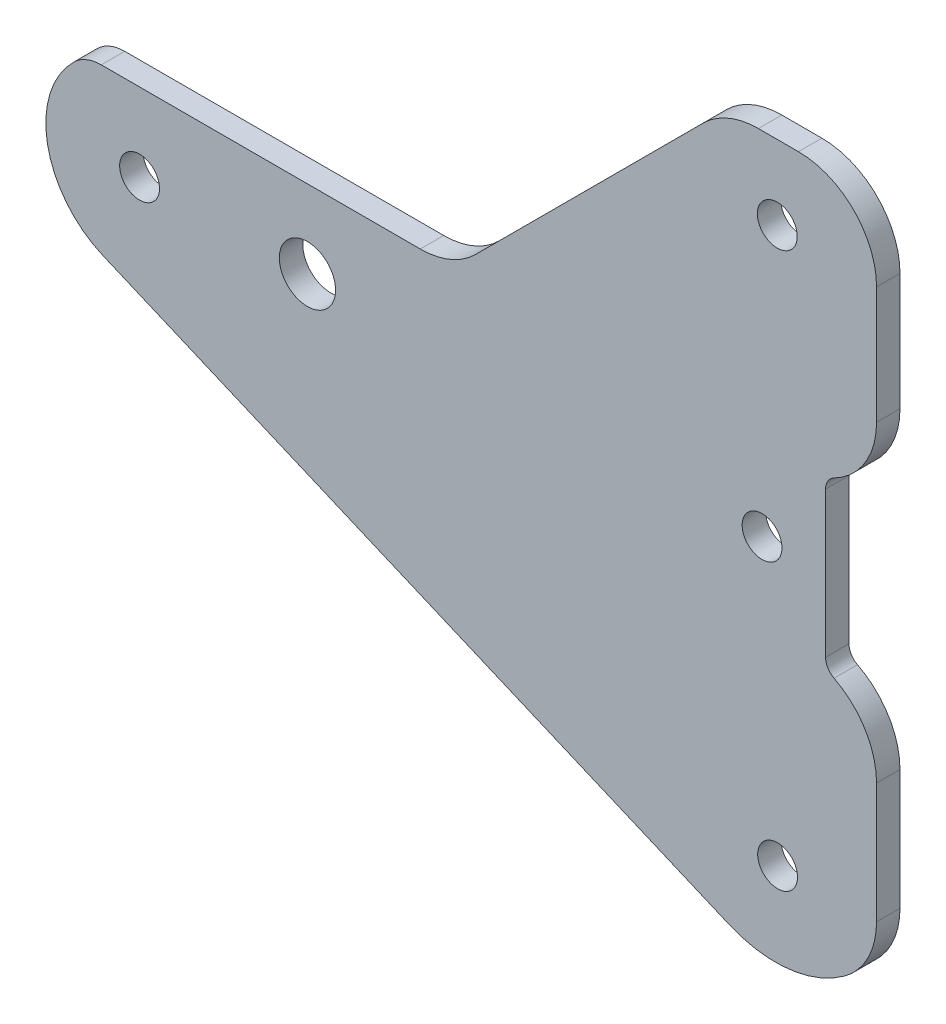
ISO-10303-21;
HEADER;
FILE_DESCRIPTION(('STEP AP214'),'2;1');
FILE_NAME('part.step','',(''),(''),'','','');
FILE_SCHEMA(('AUTOMOTIVE_DESIGN { 1 0 10303 214 1 1 1 1 }'));
ENDSEC;
DATA;
#1=APPLICATION_CONTEXT('core data for automotive mechanical design processes');
#2=APPLICATION_PROTOCOL_DEFINITION('international standard','automotive_design',2000,#1);
#3=PRODUCT_CONTEXT('',#1,'mechanical');
#4=PRODUCT('Part','Part','',(#3));
#5=PRODUCT_RELATED_PRODUCT_CATEGORY('part','',(#4));
#6=PRODUCT_DEFINITION_FORMATION('','',#4);
#7=PRODUCT_DEFINITION_CONTEXT('part definition',#1,'design');
#8=PRODUCT_DEFINITION('design','',#6,#7);
#9=PRODUCT_DEFINITION_SHAPE('','',#8);
#10=(LENGTH_UNIT() NAMED_UNIT(*) SI_UNIT(.MILLI.,.METRE.));
#11=(NAMED_UNIT(*) PLANE_ANGLE_UNIT() SI_UNIT($,.RADIAN.));
#12=(NAMED_UNIT(*) SI_UNIT($,.STERADIAN.) SOLID_ANGLE_UNIT());
#13=UNCERTAINTY_MEASURE_WITH_UNIT(LENGTH_MEASURE(1.E-05),#10,'distance_accuracy_value','');
#14=(GEOMETRIC_REPRESENTATION_CONTEXT(3) GLOBAL_UNCERTAINTY_ASSIGNED_CONTEXT((#13)) GLOBAL_UNIT_ASSIGNED_CONTEXT((#10,
#11,#12)) REPRESENTATION_CONTEXT('',''));
#15=CARTESIAN_POINT('',(0.,0.,0.));
#16=DIRECTION('',(0.,0.,1.));
#17=DIRECTION('',(1.,0.,0.));
#18=AXIS2_PLACEMENT_3D('',#15,#16,#17);
#19=CARTESIAN_POINT('',(-40.3202178649894,33.0966649260062,3.));
#20=DIRECTION('',(0.,0.,1.));
#21=DIRECTION('',(1.,0.,0.));
#22=AXIS2_PLACEMENT_3D('',#19,#20,#21);
#23=PLANE('',#22);
#24=CARTESIAN_POINT('',(46.2645708374084,-7.40903050527662,3.));
#25=DIRECTION('',(0.,0.,1.));
#26=DIRECTION('',(1.,0.,0.));
#27=AXIS2_PLACEMENT_3D('',#24,#25,#26);
#28=CIRCLE('',#27,2.55);
#29=CARTESIAN_POINT('',(48.8145708374084,-7.40903050527662,3.));
#30=VERTEX_POINT('',#29);
#31=EDGE_CURVE('E374',#30,#30,#28,.T.);
#32=ORIENTED_EDGE('',*,*,#31,.F.);
#33=EDGE_LOOP('',(#32));
#34=FACE_BOUND('',#33,.T.);
#35=CARTESIAN_POINT('',(46.2217882114393,63.594399754973,3.));
#36=DIRECTION('',(0.,0.,1.));
#37=DIRECTION('',(1.,0.,0.));
#38=AXIS2_PLACEMENT_3D('',#35,#36,#37);
#39=CIRCLE('',#38,2.55);
#40=CARTESIAN_POINT('',(48.7717882114393,63.594399754973,3.));
#41=VERTEX_POINT('',#40);
#42=EDGE_CURVE('E386',#41,#41,#39,.T.);
#43=ORIENTED_EDGE('',*,*,#42,.F.);
#44=EDGE_LOOP('',(#43));
#45=FACE_BOUND('',#44,.T.);
#46=CARTESIAN_POINT('',(-40.3202178649894,33.0966649260062,3.));
#47=DIRECTION('',(0.,0.,1.));
#48=DIRECTION('',(1.,0.,0.));
#49=AXIS2_PLACEMENT_3D('',#46,#47,#48);
#50=CIRCLE('',#49,4.99999999999999);
#51=CARTESIAN_POINT('',(-40.3202178649894,38.0966649260062,3.));
#52=VERTEX_POINT('',#51);
#53=CARTESIAN_POINT('',(-43.8194259527344,36.6681551973999,3.));
#54=VERTEX_POINT('',#53);
#55=EDGE_CURVE('E226',#52,#54,#50,.T.);
#56=ORIENTED_EDGE('',*,*,#55,.T.);
#57=CARTESIAN_POINT('',(-35.4213265421463,28.096578546055,3.));
#58=DIRECTION('',(0.,0.,1.));
#59=DIRECTION('',(1.,0.,0.));
#60=AXIS2_PLACEMENT_3D('',#57,#58,#59);
#61=CIRCLE('',#60,12.);
#62=CARTESIAN_POINT('',(-40.1158831435968,17.0529768547689,3.));
#63=VERTEX_POINT('',#62);
#64=EDGE_CURVE('E124',#54,#63,#61,.T.);
#65=ORIENTED_EDGE('',*,*,#64,.T.);
#66=DIRECTION('',(0.92030014094051,-0.391213050120874,0.));
#67=VECTOR('',#66,1.);
#68=CARTESIAN_POINT('',(-40.1158831435968,17.0529768547689,3.));
#69=LINE('',#68,#67);
#70=CARTESIAN_POINT('',(40.1158831435968,-17.0529768547689,3.));
#71=VERTEX_POINT('',#70);
#72=EDGE_CURVE('E271',#63,#71,#69,.T.);
#73=ORIENTED_EDGE('',*,*,#72,.T.);
#74=CARTESIAN_POINT('',(45.9840788954099,-3.24847474066127,3.));
#75=DIRECTION('',(0.,0.,1.));
#76=DIRECTION('',(1.,0.,0.));
#77=AXIS2_PLACEMENT_3D('',#74,#75,#76);
#78=CIRCLE('',#77,15.);
#79=CARTESIAN_POINT('',(54.8272068434977,-15.3645420933029,3.));
#80=VERTEX_POINT('',#79);
#81=EDGE_CURVE('E290',#71,#80,#78,.T.);
#82=ORIENTED_EDGE('',*,*,#81,.T.);
#83=CARTESIAN_POINT('',(48.9317882114392,-7.28716385820849,3.));
#84=DIRECTION('',(0.,0.,1.));
#85=DIRECTION('',(1.,0.,0.));
#86=AXIS2_PLACEMENT_3D('',#83,#84,#85);
#87=CIRCLE('',#86,10.);
#88=CARTESIAN_POINT('',(58.9317882114391,-7.28716385820849,3.));
#89=VERTEX_POINT('',#88);
#90=EDGE_CURVE('E287',#80,#89,#87,.T.);
#91=ORIENTED_EDGE('',*,*,#90,.T.);
#92=DIRECTION('',(0.,1.,0.));
#93=VECTOR('',#92,1.);
#94=CARTESIAN_POINT('',(58.9317882114391,-7.28716385820849,3.));
#95=LINE('',#94,#93);
#96=CARTESIAN_POINT('',(58.9317882114392,8.09283614179151,3.));
#97=VERTEX_POINT('',#96);
#98=EDGE_CURVE('E289',#89,#97,#95,.T.);
#99=ORIENTED_EDGE('',*,*,#98,.T.);
#100=CARTESIAN_POINT('',(48.9317882114392,8.09283614179151,3.));
#101=DIRECTION('',(0.,0.,1.));
#102=DIRECTION('',(1.,0.,0.));
#103=AXIS2_PLACEMENT_3D('',#100,#101,#102);
#104=CIRCLE('',#103,9.99999999999999);
#105=CARTESIAN_POINT('',(53.4901215447725,16.9934876472838,3.));
#106=VERTEX_POINT('',#105);
#107=EDGE_CURVE('E292',#97,#106,#104,.T.);
#108=ORIENTED_EDGE('',*,*,#107,.T.);
#109=CARTESIAN_POINT('',(54.4017882114392,18.7736179483823,3.));
#110=DIRECTION('',(0.,0.,-1.));
#111=DIRECTION('',(-1.,0.,0.));
#112=AXIS2_PLACEMENT_3D('',#109,#110,#111);
#113=CIRCLE('',#112,2.);
#114=CARTESIAN_POINT('',(52.4017882114392,18.7736179483823,3.));
#115=VERTEX_POINT('',#114);
#116=EDGE_CURVE('E298',#106,#115,#113,.T.);
#117=ORIENTED_EDGE('',*,*,#116,.T.);
#118=DIRECTION('',(0.,1.,0.));
#119=VECTOR('',#118,1.);
#120=CARTESIAN_POINT('',(52.4017882114392,18.7736179483823,3.));
#121=LINE('',#120,#119);
#122=CARTESIAN_POINT('',(52.4017882114392,37.4136179483823,3.));
#123=VERTEX_POINT('',#122);
#124=EDGE_CURVE('E300',#115,#123,#121,.T.);
#125=ORIENTED_EDGE('',*,*,#124,.T.);
#126=CARTESIAN_POINT('',(54.4017882114392,37.4136179483823,3.));
#127=DIRECTION('',(0.,0.,-1.));
#128=DIRECTION('',(-1.,0.,0.));
#129=AXIS2_PLACEMENT_3D('',#126,#127,#128);
#130=CIRCLE('',#129,2.);
#131=CARTESIAN_POINT('',(53.4901215447725,39.1937482494807,3.));
#132=VERTEX_POINT('',#131);
#133=EDGE_CURVE('E302',#123,#132,#130,.T.);
#134=ORIENTED_EDGE('',*,*,#133,.T.);
#135=CARTESIAN_POINT('',(48.9317882114392,48.094399754973,3.));
#136=DIRECTION('',(0.,0.,1.));
#137=DIRECTION('',(1.,0.,0.));
#138=AXIS2_PLACEMENT_3D('',#135,#136,#137);
#139=CIRCLE('',#138,10.);
#140=CARTESIAN_POINT('',(58.9317882114392,48.094399754973,3.));
#141=VERTEX_POINT('',#140);
#142=EDGE_CURVE('E304',#132,#141,#139,.T.);
#143=ORIENTED_EDGE('',*,*,#142,.T.);
#144=DIRECTION('',(0.,1.,0.));
#145=VECTOR('',#144,1.);
#146=CARTESIAN_POINT('',(58.9317882114392,48.094399754973,3.));
#147=LINE('',#146,#145);
#148=CARTESIAN_POINT('',(58.9317882114391,63.094399754973,3.));
#149=VERTEX_POINT('',#148);
#150=EDGE_CURVE('E306',#141,#149,#147,.T.);
#151=ORIENTED_EDGE('',*,*,#150,.T.);
#152=CARTESIAN_POINT('',(48.9317882114392,63.094399754973,3.));
#153=DIRECTION('',(0.,0.,1.));
#154=DIRECTION('',(1.,0.,0.));
#155=AXIS2_PLACEMENT_3D('',#152,#153,#154);
#156=CIRCLE('',#155,9.99999999999999);
#157=CARTESIAN_POINT('',(48.9317882114392,73.094399754973,3.));
#158=VERTEX_POINT('',#157);
#159=EDGE_CURVE('E308',#149,#158,#156,.T.);
#160=ORIENTED_EDGE('',*,*,#159,.T.);
#161=DIRECTION('',(-1.,0.,0.));
#162=VECTOR('',#161,1.);
#163=CARTESIAN_POINT('',(43.8017882114392,73.094399754973,3.));
#164=LINE('',#163,#162);
#165=CARTESIAN_POINT('',(43.8017882114392,73.094399754973,3.));
#166=VERTEX_POINT('',#165);
#167=EDGE_CURVE('E310',#158,#166,#164,.T.);
#168=ORIENTED_EDGE('',*,*,#167,.T.);
#169=CARTESIAN_POINT('',(43.8017882114392,63.094399754973,3.));
#170=DIRECTION('',(0.,0.,1.));
#171=DIRECTION('',(-1.,0.,0.));
#172=AXIS2_PLACEMENT_3D('',#169,#170,#171);
#173=CIRCLE('',#172,10.);
#174=CARTESIAN_POINT('',(36.7307203995736,70.1654675668385,3.));
#175=VERTEX_POINT('',#174);
#176=EDGE_CURVE('E173',#166,#175,#173,.T.);
#177=ORIENTED_EDGE('',*,*,#176,.T.);
#178=DIRECTION('',(-0.707106781186546,-0.707106781186549,0.));
#179=VECTOR('',#178,1.);
#180=CARTESIAN_POINT('',(7.59084994687604,41.0255971141408,3.));
#181=LINE('',#180,#179);
#182=CARTESIAN_POINT('',(7.59084994687608,41.0255971141408,3.));
#183=VERTEX_POINT('',#182);
#184=EDGE_CURVE('E167',#175,#183,#181,.T.);
#185=ORIENTED_EDGE('',*,*,#184,.T.);
#186=CARTESIAN_POINT('',(0.519782135010638,48.0966649260062,3.));
#187=DIRECTION('',(0.,0.,-1.));
#188=DIRECTION('',(-1.,0.,0.));
#189=AXIS2_PLACEMENT_3D('',#186,#187,#188);
#190=CIRCLE('',#189,9.99999999999993);
#191=CARTESIAN_POINT('',(0.519782135010638,38.0966649260062,3.));
#192=VERTEX_POINT('',#191);
#193=EDGE_CURVE('E171',#183,#192,#190,.T.);
#194=ORIENTED_EDGE('',*,*,#193,.T.);
#195=DIRECTION('',(-1.,0.,0.));
#196=VECTOR('',#195,1.);
#197=CARTESIAN_POINT('',(-40.3202178649894,38.0966649260062,3.));
#198=LINE('',#197,#196);
#199=EDGE_CURVE('E51',#192,#52,#198,.T.);
#200=ORIENTED_EDGE('',*,*,#199,.T.);
#201=EDGE_LOOP('',(#56,#65,#73,#82,#91,#99,#108,#117,#125,#134,#143,#151,#160,#168,#177,#185,
#194,#200));
#202=FACE_BOUND('',#201,.T.);
#203=CARTESIAN_POINT('',(-13.9313265421463,28.096578546055,3.));
#204=DIRECTION('',(0.,0.,1.));
#205=DIRECTION('',(1.,0.,0.));
#206=AXIS2_PLACEMENT_3D('',#203,#204,#205);
#207=CIRCLE('',#206,3.6);
#208=CARTESIAN_POINT('',(-10.3313265421463,28.096578546055,3.));
#209=VERTEX_POINT('',#208);
#210=EDGE_CURVE('E195',#209,#209,#207,.T.);
#211=ORIENTED_EDGE('',*,*,#210,.F.);
#212=EDGE_LOOP('',(#211));
#213=FACE_BOUND('',#212,.T.);
#214=CARTESIAN_POINT('',(44.2717882114392,28.094399754973,3.));
#215=DIRECTION('',(0.,0.,1.));
#216=DIRECTION('',(1.,0.,0.));
#217=AXIS2_PLACEMENT_3D('',#214,#215,#216);
#218=CIRCLE('',#217,2.55);
#219=CARTESIAN_POINT('',(46.8217882114392,28.094399754973,3.));
#220=VERTEX_POINT('',#219);
#221=EDGE_CURVE('E380',#220,#220,#218,.T.);
#222=ORIENTED_EDGE('',*,*,#221,.F.);
#223=EDGE_LOOP('',(#222));
#224=FACE_BOUND('',#223,.T.);
#225=CARTESIAN_POINT('',(-35.4213265421463,28.096578546055,3.));
#226=DIRECTION('',(0.,0.,1.));
#227=DIRECTION('',(1.,0.,0.));
#228=AXIS2_PLACEMENT_3D('',#225,#226,#227);
#229=CIRCLE('',#228,2.55);
#230=CARTESIAN_POINT('',(-32.8713265421463,28.096578546055,3.));
#231=VERTEX_POINT('',#230);
#232=EDGE_CURVE('E365',#231,#231,#229,.T.);
#233=ORIENTED_EDGE('',*,*,#232,.F.);
#234=EDGE_LOOP('',(#233));
#235=FACE_BOUND('',#234,.T.);
#236=ADVANCED_FACE('F34',(#34,#45,#202,#213,#224,#235),#23,.T.);
#237=CARTESIAN_POINT('',(-40.3202178649894,33.0966649260062,0.));
#238=DIRECTION('',(0.,0.,1.));
#239=DIRECTION('',(1.,0.,0.));
#240=AXIS2_PLACEMENT_3D('',#237,#238,#239);
#241=PLANE('',#240);
#242=CARTESIAN_POINT('',(-40.3202178649894,33.0966649260062,0.));
#243=DIRECTION('',(0.,0.,1.));
#244=DIRECTION('',(1.,0.,0.));
#245=AXIS2_PLACEMENT_3D('',#242,#243,#244);
#246=CIRCLE('',#245,4.99999999999999);
#247=CARTESIAN_POINT('',(-40.3202178649894,38.0966649260062,0.));
#248=VERTEX_POINT('',#247);
#249=CARTESIAN_POINT('',(-43.8194259527344,36.6681551973999,0.));
#250=VERTEX_POINT('',#249);
#251=EDGE_CURVE('E191',#248,#250,#246,.T.);
#252=ORIENTED_EDGE('',*,*,#251,.F.);
#253=DIRECTION('',(-1.,0.,0.));
#254=VECTOR('',#253,1.);
#255=CARTESIAN_POINT('',(-40.3202178649894,38.0966649260062,0.));
#256=LINE('',#255,#254);
#257=CARTESIAN_POINT('',(0.519782135010638,38.0966649260062,0.));
#258=VERTEX_POINT('',#257);
#259=EDGE_CURVE('E116',#258,#248,#256,.T.);
#260=ORIENTED_EDGE('',*,*,#259,.F.);
#261=CARTESIAN_POINT('',(0.519782135010638,48.0966649260062,0.));
#262=DIRECTION('',(0.,0.,-1.));
#263=DIRECTION('',(-1.,0.,0.));
#264=AXIS2_PLACEMENT_3D('',#261,#262,#263);
#265=CIRCLE('',#264,9.99999999999993);
#266=CARTESIAN_POINT('',(7.59084994687608,41.0255971141408,0.));
#267=VERTEX_POINT('',#266);
#268=EDGE_CURVE('E110',#267,#258,#265,.T.);
#269=ORIENTED_EDGE('',*,*,#268,.F.);
#270=DIRECTION('',(-0.707106781186546,-0.707106781186549,0.));
#271=VECTOR('',#270,1.);
#272=CARTESIAN_POINT('',(7.59084994687604,41.0255971141408,0.));
#273=LINE('',#272,#271);
#274=CARTESIAN_POINT('',(36.7307203995736,70.1654675668385,0.));
#275=VERTEX_POINT('',#274);
#276=EDGE_CURVE('E181',#275,#267,#273,.T.);
#277=ORIENTED_EDGE('',*,*,#276,.F.);
#278=CARTESIAN_POINT('',(43.8017882114392,63.094399754973,0.));
#279=DIRECTION('',(0.,0.,1.));
#280=DIRECTION('',(-1.,0.,0.));
#281=AXIS2_PLACEMENT_3D('',#278,#279,#280);
#282=CIRCLE('',#281,10.);
#283=CARTESIAN_POINT('',(43.8017882114392,73.094399754973,0.));
#284=VERTEX_POINT('',#283);
#285=EDGE_CURVE('E221',#284,#275,#282,.T.);
#286=ORIENTED_EDGE('',*,*,#285,.F.);
#287=DIRECTION('',(-1.,0.,0.));
#288=VECTOR('',#287,1.);
#289=CARTESIAN_POINT('',(43.8017882114392,73.094399754973,0.));
#290=LINE('',#289,#288);
#291=CARTESIAN_POINT('',(48.9317882114392,73.094399754973,0.));
#292=VERTEX_POINT('',#291);
#293=EDGE_CURVE('E219',#292,#284,#290,.T.);
#294=ORIENTED_EDGE('',*,*,#293,.F.);
#295=CARTESIAN_POINT('',(48.9317882114392,63.094399754973,0.));
#296=DIRECTION('',(0.,0.,1.));
#297=DIRECTION('',(1.,0.,0.));
#298=AXIS2_PLACEMENT_3D('',#295,#296,#297);
#299=CIRCLE('',#298,9.99999999999999);
#300=CARTESIAN_POINT('',(58.9317882114391,63.094399754973,0.));
#301=VERTEX_POINT('',#300);
#302=EDGE_CURVE('E217',#301,#292,#299,.T.);
#303=ORIENTED_EDGE('',*,*,#302,.F.);
#304=DIRECTION('',(0.,1.,0.));
#305=VECTOR('',#304,1.);
#306=CARTESIAN_POINT('',(58.9317882114392,48.094399754973,0.));
#307=LINE('',#306,#305);
#308=CARTESIAN_POINT('',(58.9317882114392,48.094399754973,0.));
#309=VERTEX_POINT('',#308);
#310=EDGE_CURVE('E215',#309,#301,#307,.T.);
#311=ORIENTED_EDGE('',*,*,#310,.F.);
#312=CARTESIAN_POINT('',(48.9317882114392,48.094399754973,0.));
#313=DIRECTION('',(0.,0.,1.));
#314=DIRECTION('',(1.,0.,0.));
#315=AXIS2_PLACEMENT_3D('',#312,#313,#314);
#316=CIRCLE('',#315,10.);
#317=CARTESIAN_POINT('',(53.4901215447725,39.1937482494807,0.));
#318=VERTEX_POINT('',#317);
#319=EDGE_CURVE('E213',#318,#309,#316,.T.);
#320=ORIENTED_EDGE('',*,*,#319,.F.);
#321=CARTESIAN_POINT('',(54.4017882114392,37.4136179483823,0.));
#322=DIRECTION('',(0.,0.,-1.));
#323=DIRECTION('',(-1.,0.,0.));
#324=AXIS2_PLACEMENT_3D('',#321,#322,#323);
#325=CIRCLE('',#324,2.);
#326=CARTESIAN_POINT('',(52.4017882114392,37.4136179483823,0.));
#327=VERTEX_POINT('',#326);
#328=EDGE_CURVE('E211',#327,#318,#325,.T.);
#329=ORIENTED_EDGE('',*,*,#328,.F.);
#330=DIRECTION('',(0.,1.,0.));
#331=VECTOR('',#330,1.);
#332=CARTESIAN_POINT('',(52.4017882114392,18.7736179483823,0.));
#333=LINE('',#332,#331);
#334=CARTESIAN_POINT('',(52.4017882114392,18.7736179483823,0.));
#335=VERTEX_POINT('',#334);
#336=EDGE_CURVE('E209',#335,#327,#333,.T.);
#337=ORIENTED_EDGE('',*,*,#336,.F.);
#338=CARTESIAN_POINT('',(54.4017882114392,18.7736179483823,0.));
#339=DIRECTION('',(0.,0.,-1.));
#340=DIRECTION('',(-1.,0.,0.));
#341=AXIS2_PLACEMENT_3D('',#338,#339,#340);
#342=CIRCLE('',#341,2.);
#343=CARTESIAN_POINT('',(53.4901215447725,16.9934876472838,0.));
#344=VERTEX_POINT('',#343);
#345=EDGE_CURVE('E207',#344,#335,#342,.T.);
#346=ORIENTED_EDGE('',*,*,#345,.F.);
#347=CARTESIAN_POINT('',(48.9317882114392,8.09283614179151,0.));
#348=DIRECTION('',(0.,0.,1.));
#349=DIRECTION('',(1.,0.,0.));
#350=AXIS2_PLACEMENT_3D('',#347,#348,#349);
#351=CIRCLE('',#350,9.99999999999999);
#352=CARTESIAN_POINT('',(58.9317882114392,8.09283614179151,0.));
#353=VERTEX_POINT('',#352);
#354=EDGE_CURVE('E205',#353,#344,#351,.T.);
#355=ORIENTED_EDGE('',*,*,#354,.F.);
#356=DIRECTION('',(0.,1.,0.));
#357=VECTOR('',#356,1.);
#358=CARTESIAN_POINT('',(58.9317882114391,-7.28716385820849,0.));
#359=LINE('',#358,#357);
#360=CARTESIAN_POINT('',(58.9317882114391,-7.28716385820849,0.));
#361=VERTEX_POINT('',#360);
#362=EDGE_CURVE('E203',#361,#353,#359,.T.);
#363=ORIENTED_EDGE('',*,*,#362,.F.);
#364=CARTESIAN_POINT('',(48.9317882114392,-7.28716385820849,0.));
#365=DIRECTION('',(0.,0.,1.));
#366=DIRECTION('',(1.,0.,0.));
#367=AXIS2_PLACEMENT_3D('',#364,#365,#366);
#368=CIRCLE('',#367,10.);
#369=CARTESIAN_POINT('',(54.8272068434977,-15.3645420933029,0.));
#370=VERTEX_POINT('',#369);
#371=EDGE_CURVE('E201',#370,#361,#368,.T.);
#372=ORIENTED_EDGE('',*,*,#371,.F.);
#373=CARTESIAN_POINT('',(45.9840788954099,-3.24847474066127,0.));
#374=DIRECTION('',(0.,0.,1.));
#375=DIRECTION('',(1.,0.,0.));
#376=AXIS2_PLACEMENT_3D('',#373,#374,#375);
#377=CIRCLE('',#376,15.);
#378=CARTESIAN_POINT('',(40.1158831435968,-17.0529768547689,0.));
#379=VERTEX_POINT('',#378);
#380=EDGE_CURVE('E199',#379,#370,#377,.T.);
#381=ORIENTED_EDGE('',*,*,#380,.F.);
#382=DIRECTION('',(0.92030014094051,-0.391213050120874,0.));
#383=VECTOR('',#382,1.);
#384=CARTESIAN_POINT('',(-40.1158831435968,17.0529768547689,0.));
#385=LINE('',#384,#383);
#386=CARTESIAN_POINT('',(-40.1158831435968,17.0529768547689,0.));
#387=VERTEX_POINT('',#386);
#388=EDGE_CURVE('E197',#387,#379,#385,.T.);
#389=ORIENTED_EDGE('',*,*,#388,.F.);
#390=CARTESIAN_POINT('',(-35.4213265421463,28.096578546055,0.));
#391=DIRECTION('',(0.,0.,1.));
#392=DIRECTION('',(1.,0.,0.));
#393=AXIS2_PLACEMENT_3D('',#390,#391,#392);
#394=CIRCLE('',#393,12.);
#395=EDGE_CURVE('E194',#250,#387,#394,.T.);
#396=ORIENTED_EDGE('',*,*,#395,.F.);
#397=EDGE_LOOP('',(#252,#260,#269,#277,#286,#294,#303,#311,#320,#329,#337,#346,#355,#363,#372,
#381,#389,#396));
#398=FACE_BOUND('',#397,.T.);
#399=CARTESIAN_POINT('',(-13.9313265421463,28.096578546055,0.));
#400=DIRECTION('',(0.,0.,1.));
#401=DIRECTION('',(1.,0.,0.));
#402=AXIS2_PLACEMENT_3D('',#399,#400,#401);
#403=CIRCLE('',#402,3.6);
#404=CARTESIAN_POINT('',(-10.3313265421463,28.096578546055,0.));
#405=VERTEX_POINT('',#404);
#406=EDGE_CURVE('E389',#405,#405,#403,.T.);
#407=ORIENTED_EDGE('',*,*,#406,.T.);
#408=EDGE_LOOP('',(#407));
#409=FACE_BOUND('',#408,.T.);
#410=CARTESIAN_POINT('',(46.2217882114393,63.594399754973,0.));
#411=DIRECTION('',(0.,0.,1.));
#412=DIRECTION('',(1.,0.,0.));
#413=AXIS2_PLACEMENT_3D('',#410,#411,#412);
#414=CIRCLE('',#413,2.55);
#415=CARTESIAN_POINT('',(48.7717882114393,63.594399754973,0.));
#416=VERTEX_POINT('',#415);
#417=EDGE_CURVE('E383',#416,#416,#414,.T.);
#418=ORIENTED_EDGE('',*,*,#417,.T.);
#419=EDGE_LOOP('',(#418));
#420=FACE_BOUND('',#419,.T.);
#421=CARTESIAN_POINT('',(44.2717882114392,28.094399754973,0.));
#422=DIRECTION('',(0.,0.,1.));
#423=DIRECTION('',(1.,0.,0.));
#424=AXIS2_PLACEMENT_3D('',#421,#422,#423);
#425=CIRCLE('',#424,2.55);
#426=CARTESIAN_POINT('',(46.8217882114392,28.094399754973,0.));
#427=VERTEX_POINT('',#426);
#428=EDGE_CURVE('E377',#427,#427,#425,.T.);
#429=ORIENTED_EDGE('',*,*,#428,.T.);
#430=EDGE_LOOP('',(#429));
#431=FACE_BOUND('',#430,.T.);
#432=CARTESIAN_POINT('',(46.2645708374084,-7.40903050527662,0.));
#433=DIRECTION('',(0.,0.,1.));
#434=DIRECTION('',(1.,0.,0.));
#435=AXIS2_PLACEMENT_3D('',#432,#433,#434);
#436=CIRCLE('',#435,2.55);
#437=CARTESIAN_POINT('',(48.8145708374084,-7.40903050527662,0.));
#438=VERTEX_POINT('',#437);
#439=EDGE_CURVE('E371',#438,#438,#436,.T.);
#440=ORIENTED_EDGE('',*,*,#439,.T.);
#441=EDGE_LOOP('',(#440));
#442=FACE_BOUND('',#441,.T.);
#443=CARTESIAN_POINT('',(-35.4213265421463,28.096578546055,0.));
#444=DIRECTION('',(0.,0.,1.));
#445=DIRECTION('',(1.,0.,0.));
#446=AXIS2_PLACEMENT_3D('',#443,#444,#445);
#447=CIRCLE('',#446,2.55);
#448=CARTESIAN_POINT('',(-32.8713265421463,28.096578546055,0.));
#449=VERTEX_POINT('',#448);
#450=EDGE_CURVE('E368',#449,#449,#447,.T.);
#451=ORIENTED_EDGE('',*,*,#450,.T.);
#452=EDGE_LOOP('',(#451));
#453=FACE_BOUND('',#452,.T.);
#454=ADVANCED_FACE('F275',(#398,#409,#420,#431,#442,#453),#241,.F.);
#455=CARTESIAN_POINT('',(-40.3202178649894,33.0966649260062,3.));
#456=DIRECTION('',(0.,0.,-1.));
#457=DIRECTION('',(-1.,0.,0.));
#458=AXIS2_PLACEMENT_3D('',#455,#456,#457);
#459=CYLINDRICAL_SURFACE('',#458,4.99999999999999);
#460=ORIENTED_EDGE('',*,*,#251,.T.);
#461=DIRECTION('',(0.,0.,-1.));
#462=VECTOR('',#461,1.);
#463=CARTESIAN_POINT('',(-43.8194259527344,36.6681551973999,3.));
#464=LINE('',#463,#462);
#465=EDGE_CURVE('E11',#54,#250,#464,.T.);
#466=ORIENTED_EDGE('',*,*,#465,.F.);
#467=ORIENTED_EDGE('',*,*,#55,.F.);
#468=DIRECTION('',(0.,0.,-1.));
#469=VECTOR('',#468,1.);
#470=CARTESIAN_POINT('',(-40.3202178649894,38.0966649260062,3.));
#471=LINE('',#470,#469);
#472=EDGE_CURVE('E187',#52,#248,#471,.T.);
#473=ORIENTED_EDGE('',*,*,#472,.T.);
#474=EDGE_LOOP('',(#460,#466,#467,#473));
#475=FACE_BOUND('',#474,.T.);
#476=ADVANCED_FACE('F36',(#475),#459,.T.);
#477=CARTESIAN_POINT('',(-35.4213265421463,28.096578546055,3.));
#478=DIRECTION('',(0.,0.,-1.));
#479=DIRECTION('',(-1.,0.,0.));
#480=AXIS2_PLACEMENT_3D('',#477,#478,#479);
#481=CYLINDRICAL_SURFACE('',#480,12.);
#482=ORIENTED_EDGE('',*,*,#395,.T.);
#483=DIRECTION('',(0.,0.,-1.));
#484=VECTOR('',#483,1.);
#485=CARTESIAN_POINT('',(-40.1158831435968,17.0529768547689,3.));
#486=LINE('',#485,#484);
#487=EDGE_CURVE('E43',#63,#387,#486,.T.);
#488=ORIENTED_EDGE('',*,*,#487,.F.);
#489=ORIENTED_EDGE('',*,*,#64,.F.);
#490=ORIENTED_EDGE('',*,*,#465,.T.);
#491=EDGE_LOOP('',(#482,#488,#489,#490));
#492=FACE_BOUND('',#491,.T.);
#493=ADVANCED_FACE('F568',(#492),#481,.T.);
#494=CARTESIAN_POINT('',(-40.1158831435968,17.0529768547689,3.));
#495=DIRECTION('',(0.391213050120874,0.92030014094051,0.));
#496=DIRECTION('',(-0.92030014094051,0.391213050120874,0.));
#497=AXIS2_PLACEMENT_3D('',#494,#495,#496);
#498=PLANE('',#497);
#499=ORIENTED_EDGE('',*,*,#388,.T.);
#500=DIRECTION('',(0.,0.,-1.));
#501=VECTOR('',#500,1.);
#502=CARTESIAN_POINT('',(40.1158831435968,-17.0529768547689,3.));
#503=LINE('',#502,#501);
#504=EDGE_CURVE('E263',#71,#379,#503,.T.);
#505=ORIENTED_EDGE('',*,*,#504,.F.);
#506=ORIENTED_EDGE('',*,*,#72,.F.);
#507=ORIENTED_EDGE('',*,*,#487,.T.);
#508=EDGE_LOOP('',(#499,#505,#506,#507));
#509=FACE_BOUND('',#508,.T.);
#510=ADVANCED_FACE('F269',(#509),#498,.F.);
#511=CARTESIAN_POINT('',(45.9840788954099,-3.24847474066127,3.));
#512=DIRECTION('',(0.,0.,-1.));
#513=DIRECTION('',(-1.,0.,0.));
#514=AXIS2_PLACEMENT_3D('',#511,#512,#513);
#515=CYLINDRICAL_SURFACE('',#514,15.);
#516=ORIENTED_EDGE('',*,*,#380,.T.);
#517=DIRECTION('',(0.,0.,-1.));
#518=VECTOR('',#517,1.);
#519=CARTESIAN_POINT('',(54.8272068434977,-15.3645420933029,3.));
#520=LINE('',#519,#518);
#521=EDGE_CURVE('E260',#80,#370,#520,.T.);
#522=ORIENTED_EDGE('',*,*,#521,.F.);
#523=ORIENTED_EDGE('',*,*,#81,.F.);
#524=ORIENTED_EDGE('',*,*,#504,.T.);
#525=EDGE_LOOP('',(#516,#522,#523,#524));
#526=FACE_BOUND('',#525,.T.);
#527=ADVANCED_FACE('F281',(#526),#515,.T.);
#528=CARTESIAN_POINT('',(48.9317882114392,-7.28716385820849,3.));
#529=DIRECTION('',(0.,0.,-1.));
#530=DIRECTION('',(-1.,0.,0.));
#531=AXIS2_PLACEMENT_3D('',#528,#529,#530);
#532=CYLINDRICAL_SURFACE('',#531,10.);
#533=ORIENTED_EDGE('',*,*,#371,.T.);
#534=DIRECTION('',(0.,0.,-1.));
#535=VECTOR('',#534,1.);
#536=CARTESIAN_POINT('',(58.9317882114391,-7.28716385820849,3.));
#537=LINE('',#536,#535);
#538=EDGE_CURVE('E257',#89,#361,#537,.T.);
#539=ORIENTED_EDGE('',*,*,#538,.F.);
#540=ORIENTED_EDGE('',*,*,#90,.F.);
#541=ORIENTED_EDGE('',*,*,#521,.T.);
#542=EDGE_LOOP('',(#533,#539,#540,#541));
#543=FACE_BOUND('',#542,.T.);
#544=ADVANCED_FACE('F285',(#543),#532,.T.);
#545=CARTESIAN_POINT('',(58.9317882114391,-7.28716385820849,3.));
#546=DIRECTION('',(-1.,0.,0.));
#547=DIRECTION('',(0.,-1.,0.));
#548=AXIS2_PLACEMENT_3D('',#545,#546,#547);
#549=PLANE('',#548);
#550=ORIENTED_EDGE('',*,*,#362,.T.);
#551=DIRECTION('',(0.,0.,-1.));
#552=VECTOR('',#551,1.);
#553=CARTESIAN_POINT('',(58.9317882114392,8.09283614179151,3.));
#554=LINE('',#553,#552);
#555=EDGE_CURVE('E254',#97,#353,#554,.T.);
#556=ORIENTED_EDGE('',*,*,#555,.F.);
#557=ORIENTED_EDGE('',*,*,#98,.F.);
#558=ORIENTED_EDGE('',*,*,#538,.T.);
#559=EDGE_LOOP('',(#550,#556,#557,#558));
#560=FACE_BOUND('',#559,.T.);
#561=ADVANCED_FACE('F533',(#560),#549,.F.);
#562=CARTESIAN_POINT('',(48.9317882114392,8.09283614179151,3.));
#563=DIRECTION('',(0.,0.,-1.));
#564=DIRECTION('',(-1.,0.,0.));
#565=AXIS2_PLACEMENT_3D('',#562,#563,#564);
#566=CYLINDRICAL_SURFACE('',#565,9.99999999999999);
#567=ORIENTED_EDGE('',*,*,#354,.T.);
#568=DIRECTION('',(0.,0.,-1.));
#569=VECTOR('',#568,1.);
#570=CARTESIAN_POINT('',(53.4901215447725,16.9934876472838,3.));
#571=LINE('',#570,#569);
#572=EDGE_CURVE('E251',#106,#344,#571,.T.);
#573=ORIENTED_EDGE('',*,*,#572,.F.);
#574=ORIENTED_EDGE('',*,*,#107,.F.);
#575=ORIENTED_EDGE('',*,*,#555,.T.);
#576=EDGE_LOOP('',(#567,#573,#574,#575));
#577=FACE_BOUND('',#576,.T.);
#578=ADVANCED_FACE('F523',(#577),#566,.T.);
#579=CARTESIAN_POINT('',(54.4017882114392,18.7736179483823,3.));
#580=DIRECTION('',(0.,0.,-1.));
#581=DIRECTION('',(-1.,0.,0.));
#582=AXIS2_PLACEMENT_3D('',#579,#580,#581);
#583=CYLINDRICAL_SURFACE('',#582,2.);
#584=ORIENTED_EDGE('',*,*,#345,.T.);
#585=DIRECTION('',(0.,0.,-1.));
#586=VECTOR('',#585,1.);
#587=CARTESIAN_POINT('',(52.4017882114392,18.7736179483823,3.));
#588=LINE('',#587,#586);
#589=EDGE_CURVE('E248',#115,#335,#588,.T.);
#590=ORIENTED_EDGE('',*,*,#589,.F.);
#591=ORIENTED_EDGE('',*,*,#116,.F.);
#592=ORIENTED_EDGE('',*,*,#572,.T.);
#593=EDGE_LOOP('',(#584,#590,#591,#592));
#594=FACE_BOUND('',#593,.T.);
#595=ADVANCED_FACE('F513',(#594),#583,.F.);
#596=CARTESIAN_POINT('',(52.4017882114392,18.7736179483823,3.));
#597=DIRECTION('',(-1.,0.,0.));
#598=DIRECTION('',(0.,0.,1.));
#599=AXIS2_PLACEMENT_3D('',#596,#597,#598);
#600=PLANE('',#599);
#601=ORIENTED_EDGE('',*,*,#336,.T.);
#602=DIRECTION('',(0.,0.,-1.));
#603=VECTOR('',#602,1.);
#604=CARTESIAN_POINT('',(52.4017882114392,37.4136179483823,3.));
#605=LINE('',#604,#603);
#606=EDGE_CURVE('E245',#123,#327,#605,.T.);
#607=ORIENTED_EDGE('',*,*,#606,.F.);
#608=ORIENTED_EDGE('',*,*,#124,.F.);
#609=ORIENTED_EDGE('',*,*,#589,.T.);
#610=EDGE_LOOP('',(#601,#607,#608,#609));
#611=FACE_BOUND('',#610,.T.);
#612=ADVANCED_FACE('F503',(#611),#600,.F.);
#613=CARTESIAN_POINT('',(54.4017882114392,37.4136179483823,3.));
#614=DIRECTION('',(0.,0.,-1.));
#615=DIRECTION('',(-1.,0.,0.));
#616=AXIS2_PLACEMENT_3D('',#613,#614,#615);
#617=CYLINDRICAL_SURFACE('',#616,2.);
#618=ORIENTED_EDGE('',*,*,#328,.T.);
#619=DIRECTION('',(0.,0.,-1.));
#620=VECTOR('',#619,1.);
#621=CARTESIAN_POINT('',(53.4901215447725,39.1937482494807,3.));
#622=LINE('',#621,#620);
#623=EDGE_CURVE('E242',#132,#318,#622,.T.);
#624=ORIENTED_EDGE('',*,*,#623,.F.);
#625=ORIENTED_EDGE('',*,*,#133,.F.);
#626=ORIENTED_EDGE('',*,*,#606,.T.);
#627=EDGE_LOOP('',(#618,#624,#625,#626));
#628=FACE_BOUND('',#627,.T.);
#629=ADVANCED_FACE('F493',(#628),#617,.F.);
#630=CARTESIAN_POINT('',(48.9317882114392,48.094399754973,3.));
#631=DIRECTION('',(0.,0.,-1.));
#632=DIRECTION('',(-1.,0.,0.));
#633=AXIS2_PLACEMENT_3D('',#630,#631,#632);
#634=CYLINDRICAL_SURFACE('',#633,10.);
#635=ORIENTED_EDGE('',*,*,#319,.T.);
#636=DIRECTION('',(0.,0.,-1.));
#637=VECTOR('',#636,1.);
#638=CARTESIAN_POINT('',(58.9317882114392,48.094399754973,3.));
#639=LINE('',#638,#637);
#640=EDGE_CURVE('E239',#141,#309,#639,.T.);
#641=ORIENTED_EDGE('',*,*,#640,.F.);
#642=ORIENTED_EDGE('',*,*,#142,.F.);
#643=ORIENTED_EDGE('',*,*,#623,.T.);
#644=EDGE_LOOP('',(#635,#641,#642,#643));
#645=FACE_BOUND('',#644,.T.);
#646=ADVANCED_FACE('F483',(#645),#634,.T.);
#647=CARTESIAN_POINT('',(58.9317882114392,48.094399754973,3.));
#648=DIRECTION('',(-1.,0.,0.));
#649=DIRECTION('',(0.,0.,1.));
#650=AXIS2_PLACEMENT_3D('',#647,#648,#649);
#651=PLANE('',#650);
#652=ORIENTED_EDGE('',*,*,#310,.T.);
#653=DIRECTION('',(0.,0.,-1.));
#654=VECTOR('',#653,1.);
#655=CARTESIAN_POINT('',(58.9317882114391,63.094399754973,3.));
#656=LINE('',#655,#654);
#657=EDGE_CURVE('E236',#149,#301,#656,.T.);
#658=ORIENTED_EDGE('',*,*,#657,.F.);
#659=ORIENTED_EDGE('',*,*,#150,.F.);
#660=ORIENTED_EDGE('',*,*,#640,.T.);
#661=EDGE_LOOP('',(#652,#658,#659,#660));
#662=FACE_BOUND('',#661,.T.);
#663=ADVANCED_FACE('F473',(#662),#651,.F.);
#664=CARTESIAN_POINT('',(48.9317882114392,63.094399754973,3.));
#665=DIRECTION('',(0.,0.,-1.));
#666=DIRECTION('',(-1.,0.,0.));
#667=AXIS2_PLACEMENT_3D('',#664,#665,#666);
#668=CYLINDRICAL_SURFACE('',#667,9.99999999999999);
#669=ORIENTED_EDGE('',*,*,#302,.T.);
#670=DIRECTION('',(0.,0.,-1.));
#671=VECTOR('',#670,1.);
#672=CARTESIAN_POINT('',(48.9317882114392,73.094399754973,3.));
#673=LINE('',#672,#671);
#674=EDGE_CURVE('E233',#158,#292,#673,.T.);
#675=ORIENTED_EDGE('',*,*,#674,.F.);
#676=ORIENTED_EDGE('',*,*,#159,.F.);
#677=ORIENTED_EDGE('',*,*,#657,.T.);
#678=EDGE_LOOP('',(#669,#675,#676,#677));
#679=FACE_BOUND('',#678,.T.);
#680=ADVANCED_FACE('F464',(#679),#668,.T.);
#681=CARTESIAN_POINT('',(43.8017882114392,73.094399754973,3.));
#682=DIRECTION('',(0.,-1.,0.));
#683=DIRECTION('',(0.,0.,-1.));
#684=AXIS2_PLACEMENT_3D('',#681,#682,#683);
#685=PLANE('',#684);
#686=ORIENTED_EDGE('',*,*,#293,.T.);
#687=DIRECTION('',(0.,0.,-1.));
#688=VECTOR('',#687,1.);
#689=CARTESIAN_POINT('',(43.8017882114392,73.094399754973,3.));
#690=LINE('',#689,#688);
#691=EDGE_CURVE('E230',#166,#284,#690,.T.);
#692=ORIENTED_EDGE('',*,*,#691,.F.);
#693=ORIENTED_EDGE('',*,*,#167,.F.);
#694=ORIENTED_EDGE('',*,*,#674,.T.);
#695=EDGE_LOOP('',(#686,#692,#693,#694));
#696=FACE_BOUND('',#695,.T.);
#697=ADVANCED_FACE('F316',(#696),#685,.F.);
#698=CARTESIAN_POINT('',(43.8017882114392,63.094399754973,3.));
#699=DIRECTION('',(0.,0.,-1.));
#700=DIRECTION('',(-1.,0.,0.));
#701=AXIS2_PLACEMENT_3D('',#698,#699,#700);
#702=CYLINDRICAL_SURFACE('',#701,10.);
#703=ORIENTED_EDGE('',*,*,#285,.T.);
#704=DIRECTION('',(0.,0.,-1.));
#705=VECTOR('',#704,1.);
#706=CARTESIAN_POINT('',(36.7307203995736,70.1654675668385,3.));
#707=LINE('',#706,#705);
#708=EDGE_CURVE('E182',#175,#275,#707,.T.);
#709=ORIENTED_EDGE('',*,*,#708,.F.);
#710=ORIENTED_EDGE('',*,*,#176,.F.);
#711=ORIENTED_EDGE('',*,*,#691,.T.);
#712=EDGE_LOOP('',(#703,#709,#710,#711));
#713=FACE_BOUND('',#712,.T.);
#714=ADVANCED_FACE('F320',(#713),#702,.T.);
#715=CARTESIAN_POINT('',(7.59084994687604,41.0255971141408,3.));
#716=DIRECTION('',(0.707106781186549,-0.707106781186546,0.));
#717=DIRECTION('',(0.707106781186546,0.707106781186549,0.));
#718=AXIS2_PLACEMENT_3D('',#715,#716,#717);
#719=PLANE('',#718);
#720=ORIENTED_EDGE('',*,*,#276,.T.);
#721=DIRECTION('',(0.,0.,-1.));
#722=VECTOR('',#721,1.);
#723=CARTESIAN_POINT('',(7.59084994687608,41.0255971141408,3.));
#724=LINE('',#723,#722);
#725=EDGE_CURVE('E178',#183,#267,#724,.T.);
#726=ORIENTED_EDGE('',*,*,#725,.F.);
#727=ORIENTED_EDGE('',*,*,#184,.F.);
#728=ORIENTED_EDGE('',*,*,#708,.T.);
#729=EDGE_LOOP('',(#720,#726,#727,#728));
#730=FACE_BOUND('',#729,.T.);
#731=ADVANCED_FACE('F179',(#730),#719,.F.);
#732=CARTESIAN_POINT('',(0.519782135010638,48.0966649260062,3.));
#733=DIRECTION('',(0.,0.,-1.));
#734=DIRECTION('',(-1.,0.,0.));
#735=AXIS2_PLACEMENT_3D('',#732,#733,#734);
#736=CYLINDRICAL_SURFACE('',#735,9.99999999999993);
#737=ORIENTED_EDGE('',*,*,#268,.T.);
#738=DIRECTION('',(0.,0.,-1.));
#739=VECTOR('',#738,1.);
#740=CARTESIAN_POINT('',(0.519782135010638,38.0966649260062,3.));
#741=LINE('',#740,#739);
#742=EDGE_CURVE('E183',#192,#258,#741,.T.);
#743=ORIENTED_EDGE('',*,*,#742,.F.);
#744=ORIENTED_EDGE('',*,*,#193,.F.);
#745=ORIENTED_EDGE('',*,*,#725,.T.);
#746=EDGE_LOOP('',(#737,#743,#744,#745));
#747=FACE_BOUND('',#746,.T.);
#748=ADVANCED_FACE('F185',(#747),#736,.F.);
#749=CARTESIAN_POINT('',(-40.3202178649894,38.0966649260062,3.));
#750=DIRECTION('',(0.,-1.,0.));
#751=DIRECTION('',(0.,0.,-1.));
#752=AXIS2_PLACEMENT_3D('',#749,#750,#751);
#753=PLANE('',#752);
#754=ORIENTED_EDGE('',*,*,#259,.T.);
#755=ORIENTED_EDGE('',*,*,#472,.F.);
#756=ORIENTED_EDGE('',*,*,#199,.F.);
#757=ORIENTED_EDGE('',*,*,#742,.T.);
#758=EDGE_LOOP('',(#754,#755,#756,#757));
#759=FACE_BOUND('',#758,.T.);
#760=ADVANCED_FACE('F324',(#759),#753,.F.);
#761=CARTESIAN_POINT('',(-13.9313265421463,28.096578546055,3.));
#762=DIRECTION('',(0.,0.,-1.));
#763=DIRECTION('',(-1.,0.,0.));
#764=AXIS2_PLACEMENT_3D('',#761,#762,#763);
#765=CYLINDRICAL_SURFACE('',#764,3.6);
#766=ORIENTED_EDGE('',*,*,#210,.T.);
#767=EDGE_LOOP('',(#766));
#768=FACE_BOUND('',#767,.T.);
#769=ORIENTED_EDGE('',*,*,#406,.F.);
#770=EDGE_LOOP('',(#769));
#771=FACE_BOUND('',#770,.T.);
#772=ADVANCED_FACE('F326',(#768,#771),#765,.F.);
#773=CARTESIAN_POINT('',(46.2217882114393,63.594399754973,3.));
#774=DIRECTION('',(0.,0.,-1.));
#775=DIRECTION('',(-1.,0.,0.));
#776=AXIS2_PLACEMENT_3D('',#773,#774,#775);
#777=CYLINDRICAL_SURFACE('',#776,2.55);
#778=ORIENTED_EDGE('',*,*,#42,.T.);
#779=EDGE_LOOP('',(#778));
#780=FACE_BOUND('',#779,.T.);
#781=ORIENTED_EDGE('',*,*,#417,.F.);
#782=EDGE_LOOP('',(#781));
#783=FACE_BOUND('',#782,.T.);
#784=ADVANCED_FACE('F332',(#780,#783),#777,.F.);
#785=CARTESIAN_POINT('',(44.2717882114392,28.094399754973,3.));
#786=DIRECTION('',(0.,0.,-1.));
#787=DIRECTION('',(-1.,0.,0.));
#788=AXIS2_PLACEMENT_3D('',#785,#786,#787);
#789=CYLINDRICAL_SURFACE('',#788,2.55);
#790=ORIENTED_EDGE('',*,*,#221,.T.);
#791=EDGE_LOOP('',(#790));
#792=FACE_BOUND('',#791,.T.);
#793=ORIENTED_EDGE('',*,*,#428,.F.);
#794=EDGE_LOOP('',(#793));
#795=FACE_BOUND('',#794,.T.);
#796=ADVANCED_FACE('F348',(#792,#795),#789,.F.);
#797=CARTESIAN_POINT('',(46.2645708374084,-7.40903050527662,3.));
#798=DIRECTION('',(0.,0.,-1.));
#799=DIRECTION('',(-1.,0.,0.));
#800=AXIS2_PLACEMENT_3D('',#797,#798,#799);
#801=CYLINDRICAL_SURFACE('',#800,2.55);
#802=ORIENTED_EDGE('',*,*,#31,.T.);
#803=EDGE_LOOP('',(#802));
#804=FACE_BOUND('',#803,.T.);
#805=ORIENTED_EDGE('',*,*,#439,.F.);
#806=EDGE_LOOP('',(#805));
#807=FACE_BOUND('',#806,.T.);
#808=ADVANCED_FACE('F352',(#804,#807),#801,.F.);
#809=CARTESIAN_POINT('',(-35.4213265421463,28.096578546055,3.));
#810=DIRECTION('',(0.,0.,-1.));
#811=DIRECTION('',(-1.,0.,0.));
#812=AXIS2_PLACEMENT_3D('',#809,#810,#811);
#813=CYLINDRICAL_SURFACE('',#812,2.55);
#814=ORIENTED_EDGE('',*,*,#232,.T.);
#815=EDGE_LOOP('',(#814));
#816=FACE_BOUND('',#815,.T.);
#817=ORIENTED_EDGE('',*,*,#450,.F.);
#818=EDGE_LOOP('',(#817));
#819=FACE_BOUND('',#818,.T.);
#820=ADVANCED_FACE('F356',(#816,#819),#813,.F.);
#821=CLOSED_SHELL('',(#236,#454,#476,#493,#510,#527,#544,#561,#578,#595,#612,#629,#646,#663,
#680,#697,#714,#731,#748,#760,#772,#784,#796,#808,#820));
#822=MANIFOLD_SOLID_BREP('B2',#821);
#823=ADVANCED_BREP_SHAPE_REPRESENTATION('',(#18,#822),#14);
#824=SHAPE_DEFINITION_REPRESENTATION(#9,#823);
ENDSEC;
END-ISO-10303-21;
